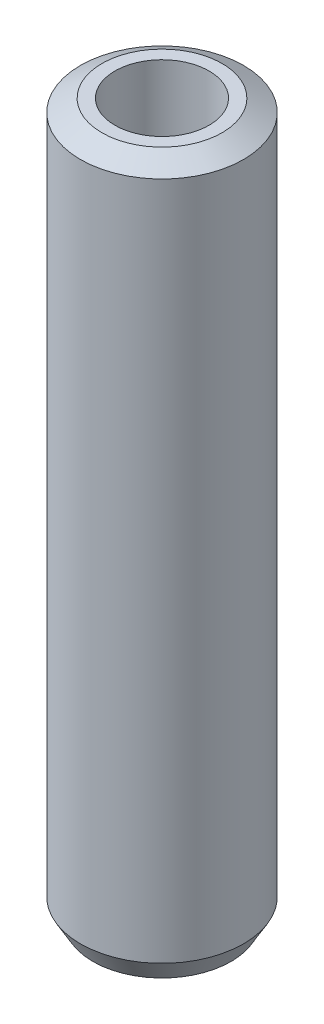
ISO-10303-21;
HEADER;
FILE_DESCRIPTION(('STEP AP214'),'2;1');
FILE_NAME('part.step','',(''),(''),'','','');
FILE_SCHEMA(('AUTOMOTIVE_DESIGN { 1 0 10303 214 1 1 1 1 }'));
ENDSEC;
DATA;
#1=APPLICATION_CONTEXT('core data for automotive mechanical design processes');
#2=APPLICATION_PROTOCOL_DEFINITION('international standard','automotive_design',2000,#1);
#3=PRODUCT_CONTEXT('',#1,'mechanical');
#4=PRODUCT('Part','Part','',(#3));
#5=PRODUCT_RELATED_PRODUCT_CATEGORY('part','',(#4));
#6=PRODUCT_DEFINITION_FORMATION('','',#4);
#7=PRODUCT_DEFINITION_CONTEXT('part definition',#1,'design');
#8=PRODUCT_DEFINITION('design','',#6,#7);
#9=PRODUCT_DEFINITION_SHAPE('','',#8);
#10=(LENGTH_UNIT() NAMED_UNIT(*) SI_UNIT(.MILLI.,.METRE.));
#11=(NAMED_UNIT(*) PLANE_ANGLE_UNIT() SI_UNIT($,.RADIAN.));
#12=(NAMED_UNIT(*) SI_UNIT($,.STERADIAN.) SOLID_ANGLE_UNIT());
#13=UNCERTAINTY_MEASURE_WITH_UNIT(LENGTH_MEASURE(1.E-05),#10,'distance_accuracy_value','');
#14=(GEOMETRIC_REPRESENTATION_CONTEXT(3) GLOBAL_UNCERTAINTY_ASSIGNED_CONTEXT((#13)) GLOBAL_UNIT_ASSIGNED_CONTEXT((#10,
#11,#12)) REPRESENTATION_CONTEXT('',''));
#15=CARTESIAN_POINT('',(0.,0.,0.));
#16=DIRECTION('',(0.,0.,1.));
#17=DIRECTION('',(1.,0.,0.));
#18=AXIS2_PLACEMENT_3D('',#15,#16,#17);
#19=CARTESIAN_POINT('',(0.,262.363190981992,0.));
#20=DIRECTION('',(0.,-1.,0.));
#21=DIRECTION('',(0.,0.,-1.));
#22=AXIS2_PLACEMENT_3D('',#19,#20,#21);
#23=CYLINDRICAL_SURFACE('',#22,30.);
#24=CARTESIAN_POINT('',(0.,257.796440518411,0.));
#25=DIRECTION('',(0.,1.,0.));
#26=DIRECTION('',(0.,0.,1.));
#27=AXIS2_PLACEMENT_3D('',#24,#25,#26);
#28=CIRCLE('',#27,30.);
#29=CARTESIAN_POINT('',(0.,257.796440518411,30.));
#30=VERTEX_POINT('',#29);
#31=EDGE_CURVE('E50',#30,#30,#28,.F.);
#32=ORIENTED_EDGE('',*,*,#31,.T.);
#33=EDGE_LOOP('',(#32));
#34=FACE_BOUND('',#33,.T.);
#35=CARTESIAN_POINT('',(0.,7.90984382841087,0.));
#36=DIRECTION('',(0.,1.,0.));
#37=DIRECTION('',(0.,0.,1.));
#38=AXIS2_PLACEMENT_3D('',#35,#36,#37);
#39=CIRCLE('',#38,30.);
#40=CARTESIAN_POINT('',(0.,7.90984382841087,30.));
#41=VERTEX_POINT('',#40);
#42=EDGE_CURVE('E51',#41,#41,#39,.T.);
#43=ORIENTED_EDGE('',*,*,#42,.T.);
#44=EDGE_LOOP('',(#43));
#45=FACE_BOUND('',#44,.T.);
#46=ADVANCED_FACE('F39',(#34,#45),#23,.T.);
#47=CARTESIAN_POINT('',(0.,262.363190981992,0.));
#48=DIRECTION('',(0.,1.,0.));
#49=DIRECTION('',(0.,0.,1.));
#50=AXIS2_PLACEMENT_3D('',#47,#48,#49);
#51=PLANE('',#50);
#52=CARTESIAN_POINT('',(0.,262.363190981992,0.));
#53=DIRECTION('',(0.,1.,0.));
#54=DIRECTION('',(0.,0.,1.));
#55=AXIS2_PLACEMENT_3D('',#52,#53,#54);
#56=CIRCLE('',#55,22.0901561715892);
#57=CARTESIAN_POINT('',(0.,262.363190981992,22.0901561715892));
#58=VERTEX_POINT('',#57);
#59=EDGE_CURVE('E54',#58,#58,#56,.T.);
#60=ORIENTED_EDGE('',*,*,#59,.T.);
#61=EDGE_LOOP('',(#60));
#62=FACE_BOUND('',#61,.T.);
#63=CARTESIAN_POINT('',(0.,262.363190981992,0.));
#64=DIRECTION('',(0.,1.,0.));
#65=DIRECTION('',(0.,0.,1.));
#66=AXIS2_PLACEMENT_3D('',#63,#64,#65);
#67=CIRCLE('',#66,17.3194614928186);
#68=CARTESIAN_POINT('',(0.,262.363190981992,17.3194614928186));
#69=VERTEX_POINT('',#68);
#70=EDGE_CURVE('E58',#69,#69,#67,.T.);
#71=ORIENTED_EDGE('',*,*,#70,.F.);
#72=EDGE_LOOP('',(#71));
#73=FACE_BOUND('',#72,.T.);
#74=ADVANCED_FACE('F69',(#62,#73),#51,.T.);
#75=CARTESIAN_POINT('',(0.,0.,0.));
#76=DIRECTION('',(0.,1.,0.));
#77=DIRECTION('',(0.,0.,1.));
#78=AXIS2_PLACEMENT_3D('',#75,#76,#77);
#79=PLANE('',#78);
#80=CARTESIAN_POINT('',(0.,0.,0.));
#81=DIRECTION('',(0.,1.,0.));
#82=DIRECTION('',(0.,0.,1.));
#83=AXIS2_PLACEMENT_3D('',#80,#81,#82);
#84=CIRCLE('',#83,25.4332495364191);
#85=CARTESIAN_POINT('',(0.,0.,25.4332495364191));
#86=VERTEX_POINT('',#85);
#87=EDGE_CURVE('E10',#86,#86,#84,.F.);
#88=ORIENTED_EDGE('',*,*,#87,.T.);
#89=EDGE_LOOP('',(#88));
#90=FACE_BOUND('',#89,.T.);
#91=CARTESIAN_POINT('',(0.,0.,0.));
#92=DIRECTION('',(0.,1.,0.));
#93=DIRECTION('',(0.,0.,1.));
#94=AXIS2_PLACEMENT_3D('',#91,#92,#93);
#95=CIRCLE('',#94,17.3194614928186);
#96=CARTESIAN_POINT('',(0.,0.,17.3194614928186));
#97=VERTEX_POINT('',#96);
#98=EDGE_CURVE('E63',#97,#97,#95,.T.);
#99=ORIENTED_EDGE('',*,*,#98,.T.);
#100=EDGE_LOOP('',(#99));
#101=FACE_BOUND('',#100,.T.);
#102=ADVANCED_FACE('F75',(#90,#101),#79,.F.);
#103=CARTESIAN_POINT('',(0.,262.363190981992,0.));
#104=DIRECTION('',(0.,-1.,0.));
#105=DIRECTION('',(0.,0.,-1.));
#106=AXIS2_PLACEMENT_3D('',#103,#104,#105);
#107=CYLINDRICAL_SURFACE('',#106,17.3194614928186);
#108=ORIENTED_EDGE('',*,*,#70,.T.);
#109=EDGE_LOOP('',(#108));
#110=FACE_BOUND('',#109,.T.);
#111=ORIENTED_EDGE('',*,*,#98,.F.);
#112=EDGE_LOOP('',(#111));
#113=FACE_BOUND('',#112,.T.);
#114=ADVANCED_FACE('F70',(#110,#113),#107,.F.);
#115=CARTESIAN_POINT('',(0.,262.363190981992,0.));
#116=DIRECTION('',(0.,-1.,0.));
#117=DIRECTION('',(0.,0.,-1.));
#118=AXIS2_PLACEMENT_3D('',#115,#116,#117);
#119=CONICAL_SURFACE('',#118,22.0901561715892,1.04719755119659);
#120=ORIENTED_EDGE('',*,*,#31,.F.);
#121=EDGE_LOOP('',(#120));
#122=FACE_BOUND('',#121,.T.);
#123=ORIENTED_EDGE('',*,*,#59,.F.);
#124=EDGE_LOOP('',(#123));
#125=FACE_BOUND('',#124,.T.);
#126=ADVANCED_FACE('F81',(#122,#125),#119,.T.);
#127=CARTESIAN_POINT('',(0.,7.90984382841087,0.));
#128=DIRECTION('',(0.,1.,0.));
#129=DIRECTION('',(0.,0.,1.));
#130=AXIS2_PLACEMENT_3D('',#127,#128,#129);
#131=CONICAL_SURFACE('',#130,30.,0.523598775598302);
#132=ORIENTED_EDGE('',*,*,#87,.F.);
#133=EDGE_LOOP('',(#132));
#134=FACE_BOUND('',#133,.T.);
#135=ORIENTED_EDGE('',*,*,#42,.F.);
#136=EDGE_LOOP('',(#135));
#137=FACE_BOUND('',#136,.T.);
#138=ADVANCED_FACE('F45',(#134,#137),#131,.T.);
#139=CLOSED_SHELL('',(#46,#74,#102,#114,#126,#138));
#140=MANIFOLD_SOLID_BREP('B2',#139);
#141=ADVANCED_BREP_SHAPE_REPRESENTATION('',(#18,#140),#14);
#142=SHAPE_DEFINITION_REPRESENTATION(#9,#141);
ENDSEC;
END-ISO-10303-21;
